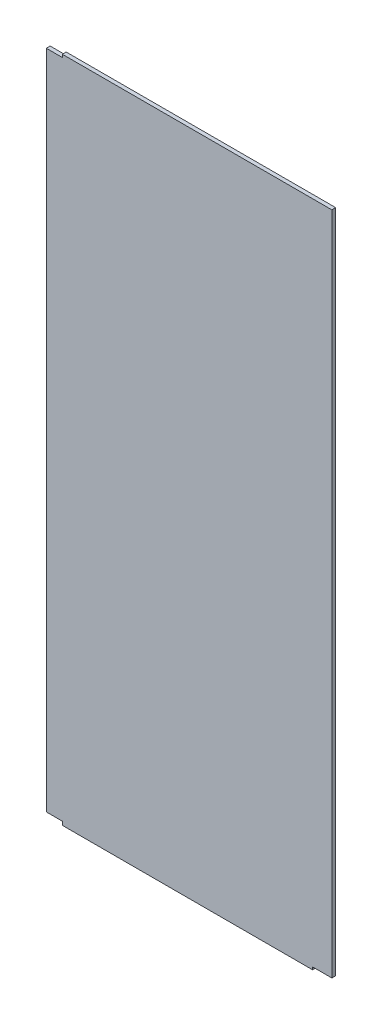
ISO-10303-21;
HEADER;
FILE_DESCRIPTION(('STEP AP214'),'2;1');
FILE_NAME('part.step','',(''),(''),'','','');
FILE_SCHEMA(('AUTOMOTIVE_DESIGN { 1 0 10303 214 1 1 1 1 }'));
ENDSEC;
DATA;
#1=APPLICATION_CONTEXT('core data for automotive mechanical design processes');
#2=APPLICATION_PROTOCOL_DEFINITION('international standard','automotive_design',2000,#1);
#3=PRODUCT_CONTEXT('',#1,'mechanical');
#4=PRODUCT('Part','Part','',(#3));
#5=PRODUCT_RELATED_PRODUCT_CATEGORY('part','',(#4));
#6=PRODUCT_DEFINITION_FORMATION('','',#4);
#7=PRODUCT_DEFINITION_CONTEXT('part definition',#1,'design');
#8=PRODUCT_DEFINITION('design','',#6,#7);
#9=PRODUCT_DEFINITION_SHAPE('','',#8);
#10=(LENGTH_UNIT() NAMED_UNIT(*) SI_UNIT(.MILLI.,.METRE.));
#11=(NAMED_UNIT(*) PLANE_ANGLE_UNIT() SI_UNIT($,.RADIAN.));
#12=(NAMED_UNIT(*) SI_UNIT($,.STERADIAN.) SOLID_ANGLE_UNIT());
#13=UNCERTAINTY_MEASURE_WITH_UNIT(LENGTH_MEASURE(1.E-05),#10,'distance_accuracy_value','');
#14=(GEOMETRIC_REPRESENTATION_CONTEXT(3) GLOBAL_UNCERTAINTY_ASSIGNED_CONTEXT((#13)) GLOBAL_UNIT_ASSIGNED_CONTEXT((#10,
#11,#12)) REPRESENTATION_CONTEXT('',''));
#15=CARTESIAN_POINT('',(0.,0.,0.));
#16=DIRECTION('',(0.,0.,1.));
#17=DIRECTION('',(1.,0.,0.));
#18=AXIS2_PLACEMENT_3D('',#15,#16,#17);
#19=CARTESIAN_POINT('',(-224.443201015205,-224.668421052632,3.));
#20=DIRECTION('',(1.,0.,0.));
#21=DIRECTION('',(0.,0.,-1.));
#22=AXIS2_PLACEMENT_3D('',#19,#20,#21);
#23=PLANE('',#22);
#24=DIRECTION('',(0.,-1.,0.));
#25=VECTOR('',#24,1.);
#26=CARTESIAN_POINT('',(-224.443201015205,-224.668421052632,0.));
#27=LINE('',#26,#25);
#28=CARTESIAN_POINT('',(-224.443201015205,-221.868421052632,0.));
#29=VERTEX_POINT('',#28);
#30=CARTESIAN_POINT('',(-224.443201015205,-224.668421052632,0.));
#31=VERTEX_POINT('',#30);
#32=EDGE_CURVE('E140',#29,#31,#27,.T.);
#33=ORIENTED_EDGE('',*,*,#32,.T.);
#34=DIRECTION('',(0.,0.,-1.));
#35=VECTOR('',#34,1.);
#36=CARTESIAN_POINT('',(-224.443201015205,-224.668421052632,3.));
#37=LINE('',#36,#35);
#38=CARTESIAN_POINT('',(-224.443201015205,-224.668421052632,3.));
#39=VERTEX_POINT('',#38);
#40=EDGE_CURVE('E11',#39,#31,#37,.T.);
#41=ORIENTED_EDGE('',*,*,#40,.F.);
#42=DIRECTION('',(0.,-1.,0.));
#43=VECTOR('',#42,1.);
#44=CARTESIAN_POINT('',(-224.443201015205,-224.668421052632,3.));
#45=LINE('',#44,#43);
#46=CARTESIAN_POINT('',(-224.443201015205,-221.868421052632,3.));
#47=VERTEX_POINT('',#46);
#48=EDGE_CURVE('E158',#47,#39,#45,.T.);
#49=ORIENTED_EDGE('',*,*,#48,.F.);
#50=DIRECTION('',(0.,0.,-1.));
#51=VECTOR('',#50,1.);
#52=CARTESIAN_POINT('',(-224.443201015205,-221.868421052632,3.));
#53=LINE('',#52,#51);
#54=EDGE_CURVE('E136',#47,#29,#53,.T.);
#55=ORIENTED_EDGE('',*,*,#54,.T.);
#56=EDGE_LOOP('',(#33,#41,#49,#55));
#57=FACE_BOUND('',#56,.T.);
#58=ADVANCED_FACE('F32',(#57),#23,.F.);
#59=CARTESIAN_POINT('',(-224.443201015205,-224.668421052632,3.));
#60=DIRECTION('',(0.,1.,0.));
#61=DIRECTION('',(-1.,0.,0.));
#62=AXIS2_PLACEMENT_3D('',#59,#60,#61);
#63=PLANE('',#62);
#64=DIRECTION('',(1.,0.,0.));
#65=VECTOR('',#64,1.);
#66=CARTESIAN_POINT('',(-224.443201015205,-224.668421052632,0.));
#67=LINE('',#66,#65);
#68=CARTESIAN_POINT('',(-29.2432010152047,-224.668421052632,0.));
#69=VERTEX_POINT('',#68);
#70=EDGE_CURVE('E143',#31,#69,#67,.T.);
#71=ORIENTED_EDGE('',*,*,#70,.T.);
#72=DIRECTION('',(0.,0.,-1.));
#73=VECTOR('',#72,1.);
#74=CARTESIAN_POINT('',(-29.2432010152047,-224.668421052632,3.));
#75=LINE('',#74,#73);
#76=CARTESIAN_POINT('',(-29.2432010152047,-224.668421052632,3.));
#77=VERTEX_POINT('',#76);
#78=EDGE_CURVE('E40',#77,#69,#75,.T.);
#79=ORIENTED_EDGE('',*,*,#78,.F.);
#80=DIRECTION('',(1.,0.,0.));
#81=VECTOR('',#80,1.);
#82=CARTESIAN_POINT('',(-224.443201015205,-224.668421052632,3.));
#83=LINE('',#82,#81);
#84=EDGE_CURVE('E97',#39,#77,#83,.T.);
#85=ORIENTED_EDGE('',*,*,#84,.F.);
#86=ORIENTED_EDGE('',*,*,#40,.T.);
#87=EDGE_LOOP('',(#71,#79,#85,#86));
#88=FACE_BOUND('',#87,.T.);
#89=ADVANCED_FACE('F207',(#88),#63,.F.);
#90=CARTESIAN_POINT('',(-29.2432010152047,-224.668421052632,3.));
#91=DIRECTION('',(-1.,0.,0.));
#92=DIRECTION('',(0.,0.,1.));
#93=AXIS2_PLACEMENT_3D('',#90,#91,#92);
#94=PLANE('',#93);
#95=DIRECTION('',(0.,1.,0.));
#96=VECTOR('',#95,1.);
#97=CARTESIAN_POINT('',(-29.2432010152047,-224.668421052632,0.));
#98=LINE('',#97,#96);
#99=CARTESIAN_POINT('',(-29.2432010152047,-222.668421052631,0.));
#100=VERTEX_POINT('',#99);
#101=EDGE_CURVE('E145',#69,#100,#98,.T.);
#102=ORIENTED_EDGE('',*,*,#101,.T.);
#103=DIRECTION('',(0.,0.,-1.));
#104=VECTOR('',#103,1.);
#105=CARTESIAN_POINT('',(-29.2432010152047,-222.668421052631,3.));
#106=LINE('',#105,#104);
#107=CARTESIAN_POINT('',(-29.2432010152047,-222.668421052631,3.));
#108=VERTEX_POINT('',#107);
#109=EDGE_CURVE('E171',#108,#100,#106,.T.);
#110=ORIENTED_EDGE('',*,*,#109,.F.);
#111=DIRECTION('',(0.,1.,0.));
#112=VECTOR('',#111,1.);
#113=CARTESIAN_POINT('',(-29.2432010152047,-224.668421052632,3.));
#114=LINE('',#113,#112);
#115=EDGE_CURVE('E179',#77,#108,#114,.T.);
#116=ORIENTED_EDGE('',*,*,#115,.F.);
#117=ORIENTED_EDGE('',*,*,#78,.T.);
#118=EDGE_LOOP('',(#102,#110,#116,#117));
#119=FACE_BOUND('',#118,.T.);
#120=ADVANCED_FACE('F177',(#119),#94,.F.);
#121=CARTESIAN_POINT('',(-29.2432010152047,-222.668421052631,3.));
#122=DIRECTION('',(0.,1.,0.));
#123=DIRECTION('',(-1.,0.,0.));
#124=AXIS2_PLACEMENT_3D('',#121,#122,#123);
#125=PLANE('',#124);
#126=DIRECTION('',(1.,0.,0.));
#127=VECTOR('',#126,1.);
#128=CARTESIAN_POINT('',(-29.2432010152047,-222.668421052631,0.));
#129=LINE('',#128,#127);
#130=CARTESIAN_POINT('',(-14.2432010152047,-222.668421052631,0.));
#131=VERTEX_POINT('',#130);
#132=EDGE_CURVE('E147',#100,#131,#129,.T.);
#133=ORIENTED_EDGE('',*,*,#132,.T.);
#134=DIRECTION('',(0.,0.,-1.));
#135=VECTOR('',#134,1.);
#136=CARTESIAN_POINT('',(-14.2432010152047,-222.668421052631,3.));
#137=LINE('',#136,#135);
#138=CARTESIAN_POINT('',(-14.2432010152047,-222.668421052631,3.));
#139=VERTEX_POINT('',#138);
#140=EDGE_CURVE('E168',#139,#131,#137,.T.);
#141=ORIENTED_EDGE('',*,*,#140,.F.);
#142=DIRECTION('',(1.,0.,0.));
#143=VECTOR('',#142,1.);
#144=CARTESIAN_POINT('',(-29.2432010152047,-222.668421052631,3.));
#145=LINE('',#144,#143);
#146=EDGE_CURVE('E197',#108,#139,#145,.T.);
#147=ORIENTED_EDGE('',*,*,#146,.F.);
#148=ORIENTED_EDGE('',*,*,#109,.T.);
#149=EDGE_LOOP('',(#133,#141,#147,#148));
#150=FACE_BOUND('',#149,.T.);
#151=ADVANCED_FACE('F188',(#150),#125,.F.);
#152=CARTESIAN_POINT('',(-14.2432010152048,296.131578947368,3.));
#153=DIRECTION('',(-1.,0.,0.));
#154=DIRECTION('',(0.,-1.,0.));
#155=AXIS2_PLACEMENT_3D('',#152,#153,#154);
#156=PLANE('',#155);
#157=DIRECTION('',(0.,1.,0.));
#158=VECTOR('',#157,1.);
#159=CARTESIAN_POINT('',(-14.2432010152048,296.131578947368,0.));
#160=LINE('',#159,#158);
#161=CARTESIAN_POINT('',(-14.2432010152048,296.131578947368,0.));
#162=VERTEX_POINT('',#161);
#163=EDGE_CURVE('E149',#131,#162,#160,.T.);
#164=ORIENTED_EDGE('',*,*,#163,.T.);
#165=DIRECTION('',(0.,0.,-1.));
#166=VECTOR('',#165,1.);
#167=CARTESIAN_POINT('',(-14.2432010152048,296.131578947368,3.));
#168=LINE('',#167,#166);
#169=CARTESIAN_POINT('',(-14.2432010152048,296.131578947368,3.));
#170=VERTEX_POINT('',#169);
#171=EDGE_CURVE('E165',#170,#162,#168,.T.);
#172=ORIENTED_EDGE('',*,*,#171,.F.);
#173=DIRECTION('',(0.,1.,0.));
#174=VECTOR('',#173,1.);
#175=CARTESIAN_POINT('',(-14.2432010152048,296.131578947368,3.));
#176=LINE('',#175,#174);
#177=EDGE_CURVE('E194',#139,#170,#176,.T.);
#178=ORIENTED_EDGE('',*,*,#177,.F.);
#179=ORIENTED_EDGE('',*,*,#140,.T.);
#180=EDGE_LOOP('',(#164,#172,#178,#179));
#181=FACE_BOUND('',#180,.T.);
#182=ADVANCED_FACE('F192',(#181),#156,.F.);
#183=CARTESIAN_POINT('',(-224.443201015205,296.131578947368,3.));
#184=DIRECTION('',(0.,-1.,0.));
#185=DIRECTION('',(0.,0.,-1.));
#186=AXIS2_PLACEMENT_3D('',#183,#184,#185);
#187=PLANE('',#186);
#188=DIRECTION('',(-1.,0.,0.));
#189=VECTOR('',#188,1.);
#190=CARTESIAN_POINT('',(-224.443201015205,296.131578947368,0.));
#191=LINE('',#190,#189);
#192=CARTESIAN_POINT('',(-224.443201015205,296.131578947368,0.));
#193=VERTEX_POINT('',#192);
#194=EDGE_CURVE('E151',#162,#193,#191,.T.);
#195=ORIENTED_EDGE('',*,*,#194,.T.);
#196=DIRECTION('',(0.,0.,-1.));
#197=VECTOR('',#196,1.);
#198=CARTESIAN_POINT('',(-224.443201015205,296.131578947368,3.));
#199=LINE('',#198,#197);
#200=CARTESIAN_POINT('',(-224.443201015205,296.131578947368,3.));
#201=VERTEX_POINT('',#200);
#202=EDGE_CURVE('E162',#201,#193,#199,.T.);
#203=ORIENTED_EDGE('',*,*,#202,.F.);
#204=DIRECTION('',(-1.,0.,0.));
#205=VECTOR('',#204,1.);
#206=CARTESIAN_POINT('',(-224.443201015205,296.131578947368,3.));
#207=LINE('',#206,#205);
#208=EDGE_CURVE('E196',#170,#201,#207,.T.);
#209=ORIENTED_EDGE('',*,*,#208,.F.);
#210=ORIENTED_EDGE('',*,*,#171,.T.);
#211=EDGE_LOOP('',(#195,#203,#209,#210));
#212=FACE_BOUND('',#211,.T.);
#213=ADVANCED_FACE('F219',(#212),#187,.F.);
#214=CARTESIAN_POINT('',(-224.443201015205,293.931578947368,3.));
#215=DIRECTION('',(1.,0.,0.));
#216=DIRECTION('',(0.,0.,-1.));
#217=AXIS2_PLACEMENT_3D('',#214,#215,#216);
#218=PLANE('',#217);
#219=DIRECTION('',(0.,-1.,0.));
#220=VECTOR('',#219,1.);
#221=CARTESIAN_POINT('',(-224.443201015205,293.931578947368,0.));
#222=LINE('',#221,#220);
#223=CARTESIAN_POINT('',(-224.443201015205,293.931578947368,0.));
#224=VERTEX_POINT('',#223);
#225=EDGE_CURVE('E153',#193,#224,#222,.T.);
#226=ORIENTED_EDGE('',*,*,#225,.T.);
#227=DIRECTION('',(0.,0.,-1.));
#228=VECTOR('',#227,1.);
#229=CARTESIAN_POINT('',(-224.443201015205,293.931578947368,3.));
#230=LINE('',#229,#228);
#231=CARTESIAN_POINT('',(-224.443201015205,293.931578947368,3.));
#232=VERTEX_POINT('',#231);
#233=EDGE_CURVE('E131',#232,#224,#230,.T.);
#234=ORIENTED_EDGE('',*,*,#233,.F.);
#235=DIRECTION('',(0.,-1.,0.));
#236=VECTOR('',#235,1.);
#237=CARTESIAN_POINT('',(-224.443201015205,293.931578947368,3.));
#238=LINE('',#237,#236);
#239=EDGE_CURVE('E122',#201,#232,#238,.T.);
#240=ORIENTED_EDGE('',*,*,#239,.F.);
#241=ORIENTED_EDGE('',*,*,#202,.T.);
#242=EDGE_LOOP('',(#226,#234,#240,#241));
#243=FACE_BOUND('',#242,.T.);
#244=ADVANCED_FACE('F222',(#243),#218,.F.);
#245=CARTESIAN_POINT('',(-236.943201015205,293.931578947368,3.));
#246=DIRECTION('',(0.,-1.,0.));
#247=DIRECTION('',(0.,0.,-1.));
#248=AXIS2_PLACEMENT_3D('',#245,#246,#247);
#249=PLANE('',#248);
#250=DIRECTION('',(-1.,0.,0.));
#251=VECTOR('',#250,1.);
#252=CARTESIAN_POINT('',(-236.943201015205,293.931578947368,0.));
#253=LINE('',#252,#251);
#254=CARTESIAN_POINT('',(-236.943201015205,293.931578947368,0.));
#255=VERTEX_POINT('',#254);
#256=EDGE_CURVE('E130',#224,#255,#253,.T.);
#257=ORIENTED_EDGE('',*,*,#256,.T.);
#258=DIRECTION('',(0.,0.,-1.));
#259=VECTOR('',#258,1.);
#260=CARTESIAN_POINT('',(-236.943201015205,293.931578947368,3.));
#261=LINE('',#260,#259);
#262=CARTESIAN_POINT('',(-236.943201015205,293.931578947368,3.));
#263=VERTEX_POINT('',#262);
#264=EDGE_CURVE('E127',#263,#255,#261,.T.);
#265=ORIENTED_EDGE('',*,*,#264,.F.);
#266=DIRECTION('',(-1.,0.,0.));
#267=VECTOR('',#266,1.);
#268=CARTESIAN_POINT('',(-236.943201015205,293.931578947368,3.));
#269=LINE('',#268,#267);
#270=EDGE_CURVE('E116',#232,#263,#269,.T.);
#271=ORIENTED_EDGE('',*,*,#270,.F.);
#272=ORIENTED_EDGE('',*,*,#233,.T.);
#273=EDGE_LOOP('',(#257,#265,#271,#272));
#274=FACE_BOUND('',#273,.T.);
#275=ADVANCED_FACE('F128',(#274),#249,.F.);
#276=CARTESIAN_POINT('',(-236.943201015205,293.931578947368,3.));
#277=DIRECTION('',(1.,0.,0.));
#278=DIRECTION('',(0.,1.,0.));
#279=AXIS2_PLACEMENT_3D('',#276,#277,#278);
#280=PLANE('',#279);
#281=DIRECTION('',(0.,-1.,0.));
#282=VECTOR('',#281,1.);
#283=CARTESIAN_POINT('',(-236.943201015205,293.931578947368,0.));
#284=LINE('',#283,#282);
#285=CARTESIAN_POINT('',(-236.943201015205,-221.868421052632,0.));
#286=VERTEX_POINT('',#285);
#287=EDGE_CURVE('E83',#255,#286,#284,.T.);
#288=ORIENTED_EDGE('',*,*,#287,.T.);
#289=DIRECTION('',(0.,0.,-1.));
#290=VECTOR('',#289,1.);
#291=CARTESIAN_POINT('',(-236.943201015205,-221.868421052632,3.));
#292=LINE('',#291,#290);
#293=CARTESIAN_POINT('',(-236.943201015205,-221.868421052632,3.));
#294=VERTEX_POINT('',#293);
#295=EDGE_CURVE('E132',#294,#286,#292,.T.);
#296=ORIENTED_EDGE('',*,*,#295,.F.);
#297=DIRECTION('',(0.,-1.,0.));
#298=VECTOR('',#297,1.);
#299=CARTESIAN_POINT('',(-236.943201015205,293.931578947368,3.));
#300=LINE('',#299,#298);
#301=EDGE_CURVE('E120',#263,#294,#300,.T.);
#302=ORIENTED_EDGE('',*,*,#301,.F.);
#303=ORIENTED_EDGE('',*,*,#264,.T.);
#304=EDGE_LOOP('',(#288,#296,#302,#303));
#305=FACE_BOUND('',#304,.T.);
#306=ADVANCED_FACE('F134',(#305),#280,.F.);
#307=CARTESIAN_POINT('',(-224.443201015205,-221.868421052632,3.));
#308=DIRECTION('',(0.,1.,0.));
#309=DIRECTION('',(-1.,0.,0.));
#310=AXIS2_PLACEMENT_3D('',#307,#308,#309);
#311=PLANE('',#310);
#312=DIRECTION('',(1.,0.,0.));
#313=VECTOR('',#312,1.);
#314=CARTESIAN_POINT('',(-224.443201015205,-221.868421052632,0.));
#315=LINE('',#314,#313);
#316=EDGE_CURVE('E89',#286,#29,#315,.T.);
#317=ORIENTED_EDGE('',*,*,#316,.T.);
#318=ORIENTED_EDGE('',*,*,#54,.F.);
#319=DIRECTION('',(1.,0.,0.));
#320=VECTOR('',#319,1.);
#321=CARTESIAN_POINT('',(-224.443201015205,-221.868421052632,3.));
#322=LINE('',#321,#320);
#323=EDGE_CURVE('E48',#294,#47,#322,.T.);
#324=ORIENTED_EDGE('',*,*,#323,.F.);
#325=ORIENTED_EDGE('',*,*,#295,.T.);
#326=EDGE_LOOP('',(#317,#318,#324,#325));
#327=FACE_BOUND('',#326,.T.);
#328=ADVANCED_FACE('F231',(#327),#311,.F.);
#329=CARTESIAN_POINT('',(0.,0.,3.));
#330=DIRECTION('',(0.,0.,1.));
#331=DIRECTION('',(1.,0.,0.));
#332=AXIS2_PLACEMENT_3D('',#329,#330,#331);
#333=PLANE('',#332);
#334=ORIENTED_EDGE('',*,*,#48,.T.);
#335=ORIENTED_EDGE('',*,*,#84,.T.);
#336=ORIENTED_EDGE('',*,*,#115,.T.);
#337=ORIENTED_EDGE('',*,*,#146,.T.);
#338=ORIENTED_EDGE('',*,*,#177,.T.);
#339=ORIENTED_EDGE('',*,*,#208,.T.);
#340=ORIENTED_EDGE('',*,*,#239,.T.);
#341=ORIENTED_EDGE('',*,*,#270,.T.);
#342=ORIENTED_EDGE('',*,*,#301,.T.);
#343=ORIENTED_EDGE('',*,*,#323,.T.);
#344=EDGE_LOOP('',(#334,#335,#336,#337,#338,#339,#340,#341,#342,#343));
#345=FACE_BOUND('',#344,.T.);
#346=ADVANCED_FACE('F118',(#345),#333,.T.);
#347=CARTESIAN_POINT('',(0.,0.,0.));
#348=DIRECTION('',(0.,0.,1.));
#349=DIRECTION('',(1.,0.,0.));
#350=AXIS2_PLACEMENT_3D('',#347,#348,#349);
#351=PLANE('',#350);
#352=ORIENTED_EDGE('',*,*,#32,.F.);
#353=ORIENTED_EDGE('',*,*,#316,.F.);
#354=ORIENTED_EDGE('',*,*,#287,.F.);
#355=ORIENTED_EDGE('',*,*,#256,.F.);
#356=ORIENTED_EDGE('',*,*,#225,.F.);
#357=ORIENTED_EDGE('',*,*,#194,.F.);
#358=ORIENTED_EDGE('',*,*,#163,.F.);
#359=ORIENTED_EDGE('',*,*,#132,.F.);
#360=ORIENTED_EDGE('',*,*,#101,.F.);
#361=ORIENTED_EDGE('',*,*,#70,.F.);
#362=EDGE_LOOP('',(#352,#353,#354,#355,#356,#357,#358,#359,#360,#361));
#363=FACE_BOUND('',#362,.T.);
#364=ADVANCED_FACE('F183',(#363),#351,.F.);
#365=CLOSED_SHELL('',(#58,#89,#120,#151,#182,#213,#244,#275,#306,#328,#346,#364));
#366=MANIFOLD_SOLID_BREP('B2',#365);
#367=ADVANCED_BREP_SHAPE_REPRESENTATION('',(#18,#366),#14);
#368=SHAPE_DEFINITION_REPRESENTATION(#9,#367);
ENDSEC;
END-ISO-10303-21;
